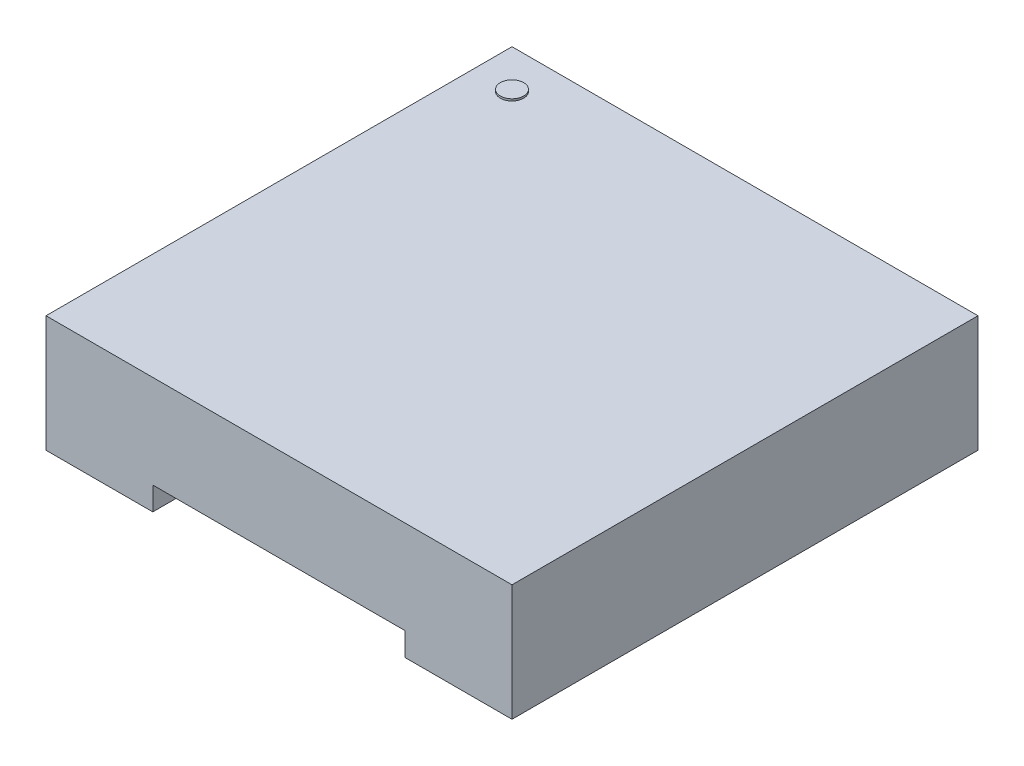
ISO-10303-21;
HEADER;
FILE_DESCRIPTION(('STEP AP214'),'2;1');
FILE_NAME('part.step','',(''),(''),'','','');
FILE_SCHEMA(('AUTOMOTIVE_DESIGN { 1 0 10303 214 1 1 1 1 }'));
ENDSEC;
DATA;
#1=APPLICATION_CONTEXT('core data for automotive mechanical design processes');
#2=APPLICATION_PROTOCOL_DEFINITION('international standard','automotive_design',2000,#1);
#3=PRODUCT_CONTEXT('',#1,'mechanical');
#4=PRODUCT('Part','Part','',(#3));
#5=PRODUCT_RELATED_PRODUCT_CATEGORY('part','',(#4));
#6=PRODUCT_DEFINITION_FORMATION('','',#4);
#7=PRODUCT_DEFINITION_CONTEXT('part definition',#1,'design');
#8=PRODUCT_DEFINITION('design','',#6,#7);
#9=PRODUCT_DEFINITION_SHAPE('','',#8);
#10=(LENGTH_UNIT() NAMED_UNIT(*) SI_UNIT(.MILLI.,.METRE.));
#11=(NAMED_UNIT(*) PLANE_ANGLE_UNIT() SI_UNIT($,.RADIAN.));
#12=(NAMED_UNIT(*) SI_UNIT($,.STERADIAN.) SOLID_ANGLE_UNIT());
#13=UNCERTAINTY_MEASURE_WITH_UNIT(LENGTH_MEASURE(1.E-05),#10,'distance_accuracy_value','');
#14=(GEOMETRIC_REPRESENTATION_CONTEXT(3) GLOBAL_UNCERTAINTY_ASSIGNED_CONTEXT((#13)) GLOBAL_UNIT_ASSIGNED_CONTEXT((#10,
#11,#12)) REPRESENTATION_CONTEXT('',''));
#15=CARTESIAN_POINT('',(0.,0.,0.));
#16=DIRECTION('',(0.,0.,1.));
#17=DIRECTION('',(1.,0.,0.));
#18=AXIS2_PLACEMENT_3D('',#15,#16,#17);
#19=CARTESIAN_POINT('',(-2.55,0.3,4.6));
#20=DIRECTION('',(0.,-1.,0.));
#21=DIRECTION('',(0.,0.,-1.));
#22=AXIS2_PLACEMENT_3D('',#19,#20,#21);
#23=PLANE('',#22);
#24=CARTESIAN_POINT('',(2.55,0.3,4.6));
#25=DIRECTION('',(0.,1.,0.));
#26=DIRECTION('',(0.,0.,1.));
#27=AXIS2_PLACEMENT_3D('',#24,#25,#26);
#28=CIRCLE('',#27,0.7);
#29=CARTESIAN_POINT('',(2.55,0.3,3.9));
#30=VERTEX_POINT('',#29);
#31=CARTESIAN_POINT('',(3.25,0.3,4.6));
#32=VERTEX_POINT('',#31);
#33=EDGE_CURVE('E18',#30,#32,#28,.F.);
#34=ORIENTED_EDGE('',*,*,#33,.T.);
#35=DIRECTION('',(-1.,0.,0.));
#36=VECTOR('',#35,1.);
#37=CARTESIAN_POINT('',(-3.25,0.3,4.6));
#38=LINE('',#37,#36);
#39=CARTESIAN_POINT('',(-3.25,0.3,4.6));
#40=VERTEX_POINT('',#39);
#41=EDGE_CURVE('E124',#32,#40,#38,.T.);
#42=ORIENTED_EDGE('',*,*,#41,.T.);
#43=CARTESIAN_POINT('',(-2.55,0.3,4.6));
#44=DIRECTION('',(0.,1.,0.));
#45=DIRECTION('',(0.,0.,1.));
#46=AXIS2_PLACEMENT_3D('',#43,#44,#45);
#47=CIRCLE('',#46,0.7);
#48=CARTESIAN_POINT('',(-2.55,0.3,3.9));
#49=VERTEX_POINT('',#48);
#50=EDGE_CURVE('E183',#40,#49,#47,.F.);
#51=ORIENTED_EDGE('',*,*,#50,.T.);
#52=DIRECTION('',(-1.,0.,0.));
#53=VECTOR('',#52,1.);
#54=CARTESIAN_POINT('',(-2.55,0.3,3.9));
#55=LINE('',#54,#53);
#56=EDGE_CURVE('E127',#49,#30,#55,.F.);
#57=ORIENTED_EDGE('',*,*,#56,.T.);
#58=EDGE_LOOP('',(#34,#42,#51,#57));
#59=FACE_BOUND('',#58,.T.);
#60=ADVANCED_FACE('F15',(#59),#23,.T.);
#61=CARTESIAN_POINT('',(-3.25,0.3,4.6));
#62=DIRECTION('',(0.,0.,-1.));
#63=DIRECTION('',(-1.,0.,0.));
#64=AXIS2_PLACEMENT_3D('',#61,#62,#63);
#65=PLANE('',#64);
#66=DIRECTION('',(0.,1.,0.));
#67=VECTOR('',#66,1.);
#68=CARTESIAN_POINT('',(-3.25,0.6,4.6));
#69=LINE('',#68,#67);
#70=CARTESIAN_POINT('',(-3.25,0.6,4.6));
#71=VERTEX_POINT('',#70);
#72=EDGE_CURVE('E145',#71,#40,#69,.F.);
#73=ORIENTED_EDGE('',*,*,#72,.T.);
#74=ORIENTED_EDGE('',*,*,#41,.F.);
#75=DIRECTION('',(0.,1.,0.));
#76=VECTOR('',#75,1.);
#77=CARTESIAN_POINT('',(3.25,0.6,4.6));
#78=LINE('',#77,#76);
#79=CARTESIAN_POINT('',(3.25,0.6,4.6));
#80=VERTEX_POINT('',#79);
#81=EDGE_CURVE('E138',#32,#80,#78,.T.);
#82=ORIENTED_EDGE('',*,*,#81,.T.);
#83=DIRECTION('',(1.,0.,0.));
#84=VECTOR('',#83,1.);
#85=CARTESIAN_POINT('',(-2.55,0.6,4.6));
#86=LINE('',#85,#84);
#87=EDGE_CURVE('E165',#71,#80,#86,.T.);
#88=ORIENTED_EDGE('',*,*,#87,.F.);
#89=EDGE_LOOP('',(#73,#74,#82,#88));
#90=FACE_BOUND('',#89,.T.);
#91=ADVANCED_FACE('F142',(#90),#65,.F.);
#92=CARTESIAN_POINT('',(-3.25,0.6,6.));
#93=DIRECTION('',(-1.,0.,0.));
#94=DIRECTION('',(0.,0.,1.));
#95=AXIS2_PLACEMENT_3D('',#92,#93,#94);
#96=PLANE('',#95);
#97=DIRECTION('',(0.,1.,0.));
#98=VECTOR('',#97,1.);
#99=CARTESIAN_POINT('',(-3.25,0.6,4.6));
#100=LINE('',#99,#98);
#101=CARTESIAN_POINT('',(-3.25,0.,4.6));
#102=VERTEX_POINT('',#101);
#103=EDGE_CURVE('E162',#102,#40,#100,.T.);
#104=ORIENTED_EDGE('',*,*,#103,.T.);
#105=ORIENTED_EDGE('',*,*,#72,.F.);
#106=DIRECTION('',(0.,0.,-1.));
#107=VECTOR('',#106,1.);
#108=CARTESIAN_POINT('',(-3.25,0.6,4.6));
#109=LINE('',#108,#107);
#110=CARTESIAN_POINT('',(-3.25,0.6,6.));
#111=VERTEX_POINT('',#110);
#112=EDGE_CURVE('E155',#111,#71,#109,.T.);
#113=ORIENTED_EDGE('',*,*,#112,.F.);
#114=DIRECTION('',(0.,1.,0.));
#115=VECTOR('',#114,1.);
#116=CARTESIAN_POINT('',(-3.25,0.6,6.));
#117=LINE('',#116,#115);
#118=CARTESIAN_POINT('',(-3.25,0.,6.));
#119=VERTEX_POINT('',#118);
#120=EDGE_CURVE('E147',#119,#111,#117,.T.);
#121=ORIENTED_EDGE('',*,*,#120,.F.);
#122=DIRECTION('',(0.,0.,1.));
#123=VECTOR('',#122,1.);
#124=CARTESIAN_POINT('',(-3.25,0.,6.));
#125=LINE('',#124,#123);
#126=EDGE_CURVE('E182',#119,#102,#125,.F.);
#127=ORIENTED_EDGE('',*,*,#126,.T.);
#128=EDGE_LOOP('',(#104,#105,#113,#121,#127));
#129=FACE_BOUND('',#128,.T.);
#130=ADVANCED_FACE('F239',(#129),#96,.F.);
#131=CARTESIAN_POINT('',(-2.55,0.6,4.6));
#132=DIRECTION('',(0.,1.,0.));
#133=DIRECTION('',(0.,0.,1.));
#134=AXIS2_PLACEMENT_3D('',#131,#132,#133);
#135=CYLINDRICAL_SURFACE('',#134,0.7);
#136=ORIENTED_EDGE('',*,*,#50,.F.);
#137=ORIENTED_EDGE('',*,*,#103,.F.);
#138=CARTESIAN_POINT('',(-2.55,0.,4.6));
#139=DIRECTION('',(0.,1.,0.));
#140=DIRECTION('',(0.,0.,1.));
#141=AXIS2_PLACEMENT_3D('',#138,#139,#140);
#142=CIRCLE('',#141,0.7);
#143=CARTESIAN_POINT('',(-2.55,0.,3.9));
#144=VERTEX_POINT('',#143);
#145=EDGE_CURVE('E181',#102,#144,#142,.F.);
#146=ORIENTED_EDGE('',*,*,#145,.T.);
#147=DIRECTION('',(0.,1.,0.));
#148=VECTOR('',#147,1.);
#149=CARTESIAN_POINT('',(-2.55,0.6,3.9));
#150=LINE('',#149,#148);
#151=EDGE_CURVE('E160',#144,#49,#150,.T.);
#152=ORIENTED_EDGE('',*,*,#151,.T.);
#153=EDGE_LOOP('',(#136,#137,#146,#152));
#154=FACE_BOUND('',#153,.T.);
#155=ADVANCED_FACE('F243',(#154),#135,.F.);
#156=CARTESIAN_POINT('',(-2.55,0.6,3.9));
#157=DIRECTION('',(0.,0.,-1.));
#158=DIRECTION('',(-1.,0.,0.));
#159=AXIS2_PLACEMENT_3D('',#156,#157,#158);
#160=PLANE('',#159);
#161=ORIENTED_EDGE('',*,*,#56,.F.);
#162=ORIENTED_EDGE('',*,*,#151,.F.);
#163=DIRECTION('',(1.,0.,0.));
#164=VECTOR('',#163,1.);
#165=CARTESIAN_POINT('',(-6.,0.,3.9));
#166=LINE('',#165,#164);
#167=CARTESIAN_POINT('',(2.55,0.,3.9));
#168=VERTEX_POINT('',#167);
#169=EDGE_CURVE('E180',#144,#168,#166,.T.);
#170=ORIENTED_EDGE('',*,*,#169,.T.);
#171=DIRECTION('',(0.,1.,0.));
#172=VECTOR('',#171,1.);
#173=CARTESIAN_POINT('',(2.55,0.6,3.9));
#174=LINE('',#173,#172);
#175=EDGE_CURVE('E139',#168,#30,#174,.T.);
#176=ORIENTED_EDGE('',*,*,#175,.T.);
#177=EDGE_LOOP('',(#161,#162,#170,#176));
#178=FACE_BOUND('',#177,.T.);
#179=ADVANCED_FACE('F222',(#178),#160,.F.);
#180=CARTESIAN_POINT('',(2.55,0.6,4.6));
#181=DIRECTION('',(0.,1.,0.));
#182=DIRECTION('',(0.,0.,1.));
#183=AXIS2_PLACEMENT_3D('',#180,#181,#182);
#184=CYLINDRICAL_SURFACE('',#183,0.7);
#185=ORIENTED_EDGE('',*,*,#33,.F.);
#186=ORIENTED_EDGE('',*,*,#175,.F.);
#187=CARTESIAN_POINT('',(2.55,0.,4.6));
#188=DIRECTION('',(0.,1.,0.));
#189=DIRECTION('',(0.,0.,1.));
#190=AXIS2_PLACEMENT_3D('',#187,#188,#189);
#191=CIRCLE('',#190,0.7);
#192=CARTESIAN_POINT('',(3.25,0.,4.6));
#193=VERTEX_POINT('',#192);
#194=EDGE_CURVE('E133',#168,#193,#191,.F.);
#195=ORIENTED_EDGE('',*,*,#194,.T.);
#196=DIRECTION('',(0.,1.,0.));
#197=VECTOR('',#196,1.);
#198=CARTESIAN_POINT('',(3.25,0.6,4.6));
#199=LINE('',#198,#197);
#200=EDGE_CURVE('E130',#193,#32,#199,.T.);
#201=ORIENTED_EDGE('',*,*,#200,.T.);
#202=EDGE_LOOP('',(#185,#186,#195,#201));
#203=FACE_BOUND('',#202,.T.);
#204=ADVANCED_FACE('F131',(#203),#184,.F.);
#205=CARTESIAN_POINT('',(3.25,0.6,6.));
#206=DIRECTION('',(1.,0.,0.));
#207=DIRECTION('',(0.,0.,-1.));
#208=AXIS2_PLACEMENT_3D('',#205,#206,#207);
#209=PLANE('',#208);
#210=DIRECTION('',(0.,1.,0.));
#211=VECTOR('',#210,1.);
#212=CARTESIAN_POINT('',(3.25,0.6,6.));
#213=LINE('',#212,#211);
#214=CARTESIAN_POINT('',(3.25,0.6,6.));
#215=VERTEX_POINT('',#214);
#216=CARTESIAN_POINT('',(3.25,0.,6.));
#217=VERTEX_POINT('',#216);
#218=EDGE_CURVE('E153',#215,#217,#213,.F.);
#219=ORIENTED_EDGE('',*,*,#218,.F.);
#220=DIRECTION('',(0.,0.,-1.));
#221=VECTOR('',#220,1.);
#222=CARTESIAN_POINT('',(3.25,0.6,4.6));
#223=LINE('',#222,#221);
#224=EDGE_CURVE('E151',#80,#215,#223,.F.);
#225=ORIENTED_EDGE('',*,*,#224,.F.);
#226=ORIENTED_EDGE('',*,*,#81,.F.);
#227=ORIENTED_EDGE('',*,*,#200,.F.);
#228=DIRECTION('',(0.,0.,1.));
#229=VECTOR('',#228,1.);
#230=CARTESIAN_POINT('',(3.25,0.,6.));
#231=LINE('',#230,#229);
#232=EDGE_CURVE('E179',#193,#217,#231,.T.);
#233=ORIENTED_EDGE('',*,*,#232,.T.);
#234=EDGE_LOOP('',(#219,#225,#226,#227,#233));
#235=FACE_BOUND('',#234,.T.);
#236=ADVANCED_FACE('F149',(#235),#209,.F.);
#237=CARTESIAN_POINT('',(-0.95,1.8,-5.9));
#238=DIRECTION('',(0.,0.,1.));
#239=DIRECTION('',(1.,0.,0.));
#240=AXIS2_PLACEMENT_3D('',#237,#238,#239);
#241=PLANE('',#240);
#242=DIRECTION('',(1.,0.,0.));
#243=VECTOR('',#242,1.);
#244=CARTESIAN_POINT('',(-0.95,2.7,-5.9));
#245=LINE('',#244,#243);
#246=CARTESIAN_POINT('',(-0.95,2.7,-5.9));
#247=VERTEX_POINT('',#246);
#248=CARTESIAN_POINT('',(0.95,2.7,-5.9));
#249=VERTEX_POINT('',#248);
#250=EDGE_CURVE('E529',#247,#249,#245,.T.);
#251=ORIENTED_EDGE('',*,*,#250,.T.);
#252=DIRECTION('',(0.,1.,0.));
#253=VECTOR('',#252,1.);
#254=CARTESIAN_POINT('',(0.95,2.7,-5.9));
#255=LINE('',#254,#253);
#256=CARTESIAN_POINT('',(0.95,1.8,-5.9));
#257=VERTEX_POINT('',#256);
#258=EDGE_CURVE('E227',#249,#257,#255,.F.);
#259=ORIENTED_EDGE('',*,*,#258,.T.);
#260=DIRECTION('',(1.,0.,0.));
#261=VECTOR('',#260,1.);
#262=CARTESIAN_POINT('',(-0.95,1.8,-5.9));
#263=LINE('',#262,#261);
#264=CARTESIAN_POINT('',(-0.95,1.8,-5.9));
#265=VERTEX_POINT('',#264);
#266=EDGE_CURVE('E553',#257,#265,#263,.F.);
#267=ORIENTED_EDGE('',*,*,#266,.T.);
#268=DIRECTION('',(0.,-1.,0.));
#269=VECTOR('',#268,1.);
#270=CARTESIAN_POINT('',(-0.95,2.7,-5.9));
#271=LINE('',#270,#269);
#272=EDGE_CURVE('E533',#265,#247,#271,.F.);
#273=ORIENTED_EDGE('',*,*,#272,.T.);
#274=EDGE_LOOP('',(#251,#259,#267,#273));
#275=FACE_BOUND('',#274,.T.);
#276=ADVANCED_FACE('F305',(#275),#241,.F.);
#277=CARTESIAN_POINT('',(-2.55,0.6,4.6));
#278=DIRECTION('',(0.,-1.,0.));
#279=DIRECTION('',(0.,0.,-1.));
#280=AXIS2_PLACEMENT_3D('',#277,#278,#279);
#281=PLANE('',#280);
#282=ORIENTED_EDGE('',*,*,#224,.T.);
#283=DIRECTION('',(-1.,0.,0.));
#284=VECTOR('',#283,1.);
#285=CARTESIAN_POINT('',(-6.,0.6,6.));
#286=LINE('',#285,#284);
#287=EDGE_CURVE('E199',#215,#111,#286,.T.);
#288=ORIENTED_EDGE('',*,*,#287,.T.);
#289=ORIENTED_EDGE('',*,*,#112,.T.);
#290=ORIENTED_EDGE('',*,*,#87,.T.);
#291=EDGE_LOOP('',(#282,#288,#289,#290));
#292=FACE_BOUND('',#291,.T.);
#293=ADVANCED_FACE('F302',(#292),#281,.T.);
#294=CARTESIAN_POINT('',(-6.,0.,6.));
#295=DIRECTION('',(0.,1.,0.));
#296=DIRECTION('',(0.,0.,1.));
#297=AXIS2_PLACEMENT_3D('',#294,#295,#296);
#298=PLANE('',#297);
#299=DIRECTION('',(-1.,0.,0.));
#300=VECTOR('',#299,1.);
#301=CARTESIAN_POINT('',(-6.,0.,6.));
#302=LINE('',#301,#300);
#303=CARTESIAN_POINT('',(6.,0.,6.));
#304=VERTEX_POINT('',#303);
#305=EDGE_CURVE('E206',#304,#217,#302,.T.);
#306=ORIENTED_EDGE('',*,*,#305,.T.);
#307=ORIENTED_EDGE('',*,*,#232,.F.);
#308=ORIENTED_EDGE('',*,*,#194,.F.);
#309=ORIENTED_EDGE('',*,*,#169,.F.);
#310=ORIENTED_EDGE('',*,*,#145,.F.);
#311=ORIENTED_EDGE('',*,*,#126,.F.);
#312=DIRECTION('',(-1.,0.,0.));
#313=VECTOR('',#312,1.);
#314=CARTESIAN_POINT('',(-6.,0.,6.));
#315=LINE('',#314,#313);
#316=CARTESIAN_POINT('',(-6.,0.,6.));
#317=VERTEX_POINT('',#316);
#318=EDGE_CURVE('E195',#119,#317,#315,.T.);
#319=ORIENTED_EDGE('',*,*,#318,.T.);
#320=DIRECTION('',(0.,0.,-1.));
#321=VECTOR('',#320,1.);
#322=CARTESIAN_POINT('',(-6.,0.,-5.99999999999999));
#323=LINE('',#322,#321);
#324=CARTESIAN_POINT('',(-6.,0.,-5.99999999999999));
#325=VERTEX_POINT('',#324);
#326=EDGE_CURVE('E215',#317,#325,#323,.T.);
#327=ORIENTED_EDGE('',*,*,#326,.T.);
#328=DIRECTION('',(1.,0.,0.));
#329=VECTOR('',#328,1.);
#330=CARTESIAN_POINT('',(-6.,0.,-5.99999999999999));
#331=LINE('',#330,#329);
#332=CARTESIAN_POINT('',(6.,0.,-5.99999999999999));
#333=VERTEX_POINT('',#332);
#334=EDGE_CURVE('E569',#325,#333,#331,.T.);
#335=ORIENTED_EDGE('',*,*,#334,.T.);
#336=DIRECTION('',(0.,0.,1.));
#337=VECTOR('',#336,1.);
#338=CARTESIAN_POINT('',(5.99999999999999,0.,-5.99999999999999));
#339=LINE('',#338,#337);
#340=EDGE_CURVE('E574',#333,#304,#339,.T.);
#341=ORIENTED_EDGE('',*,*,#340,.T.);
#342=EDGE_LOOP('',(#306,#307,#308,#309,#310,#311,#319,#327,#335,#341));
#343=FACE_BOUND('',#342,.T.);
#344=ADVANCED_FACE('F225',(#343),#298,.F.);
#345=CARTESIAN_POINT('',(0.95,2.7,-5.9));
#346=DIRECTION('',(1.,0.,0.));
#347=DIRECTION('',(0.,0.,-1.));
#348=AXIS2_PLACEMENT_3D('',#345,#346,#347);
#349=PLANE('',#348);
#350=DIRECTION('',(0.,0.,1.));
#351=VECTOR('',#350,1.);
#352=CARTESIAN_POINT('',(0.95,1.8,-5.9));
#353=LINE('',#352,#351);
#354=CARTESIAN_POINT('',(0.95,1.8,-5.99999999999999));
#355=VERTEX_POINT('',#354);
#356=EDGE_CURVE('E229',#355,#257,#353,.T.);
#357=ORIENTED_EDGE('',*,*,#356,.T.);
#358=ORIENTED_EDGE('',*,*,#258,.F.);
#359=DIRECTION('',(0.,0.,1.));
#360=VECTOR('',#359,1.);
#361=CARTESIAN_POINT('',(0.95,2.7,-5.9));
#362=LINE('',#361,#360);
#363=CARTESIAN_POINT('',(0.95,2.7,-5.99999999999999));
#364=VERTEX_POINT('',#363);
#365=EDGE_CURVE('E537',#249,#364,#362,.F.);
#366=ORIENTED_EDGE('',*,*,#365,.T.);
#367=DIRECTION('',(0.,1.,0.));
#368=VECTOR('',#367,1.);
#369=CARTESIAN_POINT('',(0.95,3.,-5.99999999999999));
#370=LINE('',#369,#368);
#371=EDGE_CURVE('E560',#364,#355,#370,.F.);
#372=ORIENTED_EDGE('',*,*,#371,.T.);
#373=EDGE_LOOP('',(#357,#358,#366,#372));
#374=FACE_BOUND('',#373,.T.);
#375=ADVANCED_FACE('F295',(#374),#349,.F.);
#376=CARTESIAN_POINT('',(-0.95,1.8,-5.9));
#377=DIRECTION('',(0.,-1.,0.));
#378=DIRECTION('',(1.,0.,0.));
#379=AXIS2_PLACEMENT_3D('',#376,#377,#378);
#380=PLANE('',#379);
#381=DIRECTION('',(0.,0.,1.));
#382=VECTOR('',#381,1.);
#383=CARTESIAN_POINT('',(-0.95,1.8,-5.9));
#384=LINE('',#383,#382);
#385=CARTESIAN_POINT('',(-0.95,1.8,-5.99999999999999));
#386=VERTEX_POINT('',#385);
#387=EDGE_CURVE('E550',#386,#265,#384,.T.);
#388=ORIENTED_EDGE('',*,*,#387,.T.);
#389=ORIENTED_EDGE('',*,*,#266,.F.);
#390=ORIENTED_EDGE('',*,*,#356,.F.);
#391=DIRECTION('',(1.,0.,0.));
#392=VECTOR('',#391,1.);
#393=CARTESIAN_POINT('',(-6.,1.8,-5.99999999999999));
#394=LINE('',#393,#392);
#395=EDGE_CURVE('E556',#355,#386,#394,.F.);
#396=ORIENTED_EDGE('',*,*,#395,.T.);
#397=EDGE_LOOP('',(#388,#389,#390,#396));
#398=FACE_BOUND('',#397,.T.);
#399=ADVANCED_FACE('F291',(#398),#380,.F.);
#400=CARTESIAN_POINT('',(-0.95,2.7,-5.9));
#401=DIRECTION('',(-1.,0.,0.));
#402=DIRECTION('',(0.,-1.,0.));
#403=AXIS2_PLACEMENT_3D('',#400,#401,#402);
#404=PLANE('',#403);
#405=DIRECTION('',(0.,0.,1.));
#406=VECTOR('',#405,1.);
#407=CARTESIAN_POINT('',(-0.95,2.7,-5.9));
#408=LINE('',#407,#406);
#409=CARTESIAN_POINT('',(-0.95,2.7,-5.99999999999999));
#410=VERTEX_POINT('',#409);
#411=EDGE_CURVE('E538',#410,#247,#408,.T.);
#412=ORIENTED_EDGE('',*,*,#411,.T.);
#413=ORIENTED_EDGE('',*,*,#272,.F.);
#414=ORIENTED_EDGE('',*,*,#387,.F.);
#415=DIRECTION('',(0.,1.,0.));
#416=VECTOR('',#415,1.);
#417=CARTESIAN_POINT('',(-0.95,3.,-5.99999999999999));
#418=LINE('',#417,#416);
#419=EDGE_CURVE('E558',#386,#410,#418,.T.);
#420=ORIENTED_EDGE('',*,*,#419,.T.);
#421=EDGE_LOOP('',(#412,#413,#414,#420));
#422=FACE_BOUND('',#421,.T.);
#423=ADVANCED_FACE('F287',(#422),#404,.F.);
#424=CARTESIAN_POINT('',(-0.95,2.7,-5.9));
#425=DIRECTION('',(0.,1.,0.));
#426=DIRECTION('',(0.,0.,1.));
#427=AXIS2_PLACEMENT_3D('',#424,#425,#426);
#428=PLANE('',#427);
#429=ORIENTED_EDGE('',*,*,#365,.F.);
#430=ORIENTED_EDGE('',*,*,#250,.F.);
#431=ORIENTED_EDGE('',*,*,#411,.F.);
#432=DIRECTION('',(1.,0.,0.));
#433=VECTOR('',#432,1.);
#434=CARTESIAN_POINT('',(-6.,2.7,-5.99999999999999));
#435=LINE('',#434,#433);
#436=EDGE_CURVE('E177',#410,#364,#435,.T.);
#437=ORIENTED_EDGE('',*,*,#436,.T.);
#438=EDGE_LOOP('',(#429,#430,#431,#437));
#439=FACE_BOUND('',#438,.T.);
#440=ADVANCED_FACE('F283',(#439),#428,.F.);
#441=CARTESIAN_POINT('',(-5.,3.05,-4.99999999999999));
#442=DIRECTION('',(0.,1.,0.));
#443=DIRECTION('',(0.,0.,1.));
#444=AXIS2_PLACEMENT_3D('',#441,#442,#443);
#445=PLANE('',#444);
#446=CARTESIAN_POINT('',(-5.,3.05,-4.99999999999999));
#447=DIRECTION('',(0.,1.,0.));
#448=DIRECTION('',(0.,0.,1.));
#449=AXIS2_PLACEMENT_3D('',#446,#447,#448);
#450=CIRCLE('',#449,0.3);
#451=CARTESIAN_POINT('',(-5.,3.05,-4.69999999999999));
#452=VERTEX_POINT('',#451);
#453=EDGE_CURVE('E173',#452,#452,#450,.F.);
#454=ORIENTED_EDGE('',*,*,#453,.F.);
#455=EDGE_LOOP('',(#454));
#456=FACE_BOUND('',#455,.T.);
#457=ADVANCED_FACE('F279',(#456),#445,.T.);
#458=CARTESIAN_POINT('',(-6.,3.,-5.99999999999999));
#459=DIRECTION('',(1.,0.,0.));
#460=DIRECTION('',(0.,0.,-1.));
#461=AXIS2_PLACEMENT_3D('',#458,#459,#460);
#462=PLANE('',#461);
#463=DIRECTION('',(0.,1.,0.));
#464=VECTOR('',#463,1.);
#465=CARTESIAN_POINT('',(-6.,3.,6.));
#466=LINE('',#465,#464);
#467=CARTESIAN_POINT('',(-6.,3.,6.));
#468=VERTEX_POINT('',#467);
#469=EDGE_CURVE('E211',#317,#468,#466,.T.);
#470=ORIENTED_EDGE('',*,*,#469,.T.);
#471=DIRECTION('',(0.,0.,1.));
#472=VECTOR('',#471,1.);
#473=CARTESIAN_POINT('',(-6.,3.,6.));
#474=LINE('',#473,#472);
#475=CARTESIAN_POINT('',(-6.,3.,-5.99999999999999));
#476=VERTEX_POINT('',#475);
#477=EDGE_CURVE('E176',#476,#468,#474,.T.);
#478=ORIENTED_EDGE('',*,*,#477,.F.);
#479=DIRECTION('',(0.,1.,0.));
#480=VECTOR('',#479,1.);
#481=CARTESIAN_POINT('',(-6.,3.,-5.99999999999999));
#482=LINE('',#481,#480);
#483=EDGE_CURVE('E571',#476,#325,#482,.F.);
#484=ORIENTED_EDGE('',*,*,#483,.T.);
#485=ORIENTED_EDGE('',*,*,#326,.F.);
#486=EDGE_LOOP('',(#470,#478,#484,#485));
#487=FACE_BOUND('',#486,.T.);
#488=ADVANCED_FACE('F275',(#487),#462,.F.);
#489=CARTESIAN_POINT('',(-6.,3.,6.));
#490=DIRECTION('',(0.,0.,-1.));
#491=DIRECTION('',(-1.,0.,0.));
#492=AXIS2_PLACEMENT_3D('',#489,#490,#491);
#493=PLANE('',#492);
#494=ORIENTED_EDGE('',*,*,#120,.T.);
#495=ORIENTED_EDGE('',*,*,#287,.F.);
#496=ORIENTED_EDGE('',*,*,#218,.T.);
#497=ORIENTED_EDGE('',*,*,#305,.F.);
#498=DIRECTION('',(0.,1.,0.));
#499=VECTOR('',#498,1.);
#500=CARTESIAN_POINT('',(6.,3.,6.));
#501=LINE('',#500,#499);
#502=CARTESIAN_POINT('',(6.,3.,6.));
#503=VERTEX_POINT('',#502);
#504=EDGE_CURVE('E198',#304,#503,#501,.T.);
#505=ORIENTED_EDGE('',*,*,#504,.T.);
#506=DIRECTION('',(1.,0.,0.));
#507=VECTOR('',#506,1.);
#508=CARTESIAN_POINT('',(-6.,3.,6.));
#509=LINE('',#508,#507);
#510=EDGE_CURVE('E580',#468,#503,#509,.T.);
#511=ORIENTED_EDGE('',*,*,#510,.F.);
#512=ORIENTED_EDGE('',*,*,#469,.F.);
#513=ORIENTED_EDGE('',*,*,#318,.F.);
#514=EDGE_LOOP('',(#494,#495,#496,#497,#505,#511,#512,#513));
#515=FACE_BOUND('',#514,.T.);
#516=ADVANCED_FACE('F272',(#515),#493,.F.);
#517=CARTESIAN_POINT('',(5.99999999999999,3.,-5.99999999999999));
#518=DIRECTION('',(-1.,0.,0.));
#519=DIRECTION('',(0.,0.,1.));
#520=AXIS2_PLACEMENT_3D('',#517,#518,#519);
#521=PLANE('',#520);
#522=DIRECTION('',(0.,1.,0.));
#523=VECTOR('',#522,1.);
#524=CARTESIAN_POINT('',(5.99999999999999,3.,-5.99999999999999));
#525=LINE('',#524,#523);
#526=CARTESIAN_POINT('',(6.,3.,-5.99999999999999));
#527=VERTEX_POINT('',#526);
#528=EDGE_CURVE('E33',#333,#527,#525,.T.);
#529=ORIENTED_EDGE('',*,*,#528,.T.);
#530=DIRECTION('',(0.,0.,1.));
#531=VECTOR('',#530,1.);
#532=CARTESIAN_POINT('',(6.,3.,6.));
#533=LINE('',#532,#531);
#534=EDGE_CURVE('E583',#503,#527,#533,.F.);
#535=ORIENTED_EDGE('',*,*,#534,.F.);
#536=ORIENTED_EDGE('',*,*,#504,.F.);
#537=ORIENTED_EDGE('',*,*,#340,.F.);
#538=EDGE_LOOP('',(#529,#535,#536,#537));
#539=FACE_BOUND('',#538,.T.);
#540=ADVANCED_FACE('F268',(#539),#521,.F.);
#541=CARTESIAN_POINT('',(-6.,3.,-5.99999999999999));
#542=DIRECTION('',(0.,0.,1.));
#543=DIRECTION('',(1.,0.,0.));
#544=AXIS2_PLACEMENT_3D('',#541,#542,#543);
#545=PLANE('',#544);
#546=ORIENTED_EDGE('',*,*,#419,.F.);
#547=ORIENTED_EDGE('',*,*,#395,.F.);
#548=ORIENTED_EDGE('',*,*,#371,.F.);
#549=ORIENTED_EDGE('',*,*,#436,.F.);
#550=EDGE_LOOP('',(#546,#547,#548,#549));
#551=FACE_BOUND('',#550,.T.);
#552=ORIENTED_EDGE('',*,*,#334,.F.);
#553=ORIENTED_EDGE('',*,*,#483,.F.);
#554=DIRECTION('',(1.,0.,0.));
#555=VECTOR('',#554,1.);
#556=CARTESIAN_POINT('',(-6.,3.,-5.99999999999999));
#557=LINE('',#556,#555);
#558=EDGE_CURVE('E24',#527,#476,#557,.F.);
#559=ORIENTED_EDGE('',*,*,#558,.F.);
#560=ORIENTED_EDGE('',*,*,#528,.F.);
#561=EDGE_LOOP('',(#552,#553,#559,#560));
#562=FACE_BOUND('',#561,.T.);
#563=ADVANCED_FACE('F261',(#551,#562),#545,.F.);
#564=CARTESIAN_POINT('',(-5.,3.05,-4.99999999999999));
#565=DIRECTION('',(0.,1.,0.));
#566=DIRECTION('',(0.,0.,1.));
#567=AXIS2_PLACEMENT_3D('',#564,#565,#566);
#568=CYLINDRICAL_SURFACE('',#567,0.3);
#569=ORIENTED_EDGE('',*,*,#453,.T.);
#570=EDGE_LOOP('',(#569));
#571=FACE_BOUND('',#570,.T.);
#572=CARTESIAN_POINT('',(-5.,3.,-4.99999999999999));
#573=DIRECTION('',(0.,1.,0.));
#574=DIRECTION('',(0.,0.,1.));
#575=AXIS2_PLACEMENT_3D('',#572,#573,#574);
#576=CIRCLE('',#575,0.3);
#577=CARTESIAN_POINT('',(-5.,3.,-4.69999999999999));
#578=VERTEX_POINT('',#577);
#579=EDGE_CURVE('E9',#578,#578,#576,.F.);
#580=ORIENTED_EDGE('',*,*,#579,.F.);
#581=EDGE_LOOP('',(#580));
#582=FACE_BOUND('',#581,.T.);
#583=ADVANCED_FACE('F255',(#571,#582),#568,.T.);
#584=CARTESIAN_POINT('',(-6.,3.,6.));
#585=DIRECTION('',(0.,1.,0.));
#586=DIRECTION('',(0.,0.,1.));
#587=AXIS2_PLACEMENT_3D('',#584,#585,#586);
#588=PLANE('',#587);
#589=ORIENTED_EDGE('',*,*,#579,.T.);
#590=EDGE_LOOP('',(#589));
#591=FACE_BOUND('',#590,.T.);
#592=ORIENTED_EDGE('',*,*,#534,.T.);
#593=ORIENTED_EDGE('',*,*,#558,.T.);
#594=ORIENTED_EDGE('',*,*,#477,.T.);
#595=ORIENTED_EDGE('',*,*,#510,.T.);
#596=EDGE_LOOP('',(#592,#593,#594,#595));
#597=FACE_BOUND('',#596,.T.);
#598=ADVANCED_FACE('F253',(#591,#597),#588,.T.);
#599=CLOSED_SHELL('',(#60,#91,#130,#155,#179,#204,#236,#276,#293,#344,#375,#399,#423,#440,#457,
#488,#516,#540,#563,#583,#598));
#600=MANIFOLD_SOLID_BREP('B1',#599);
#601=ADVANCED_BREP_SHAPE_REPRESENTATION('',(#18,#600),#14);
#602=SHAPE_DEFINITION_REPRESENTATION(#9,#601);
ENDSEC;
END-ISO-10303-21;
